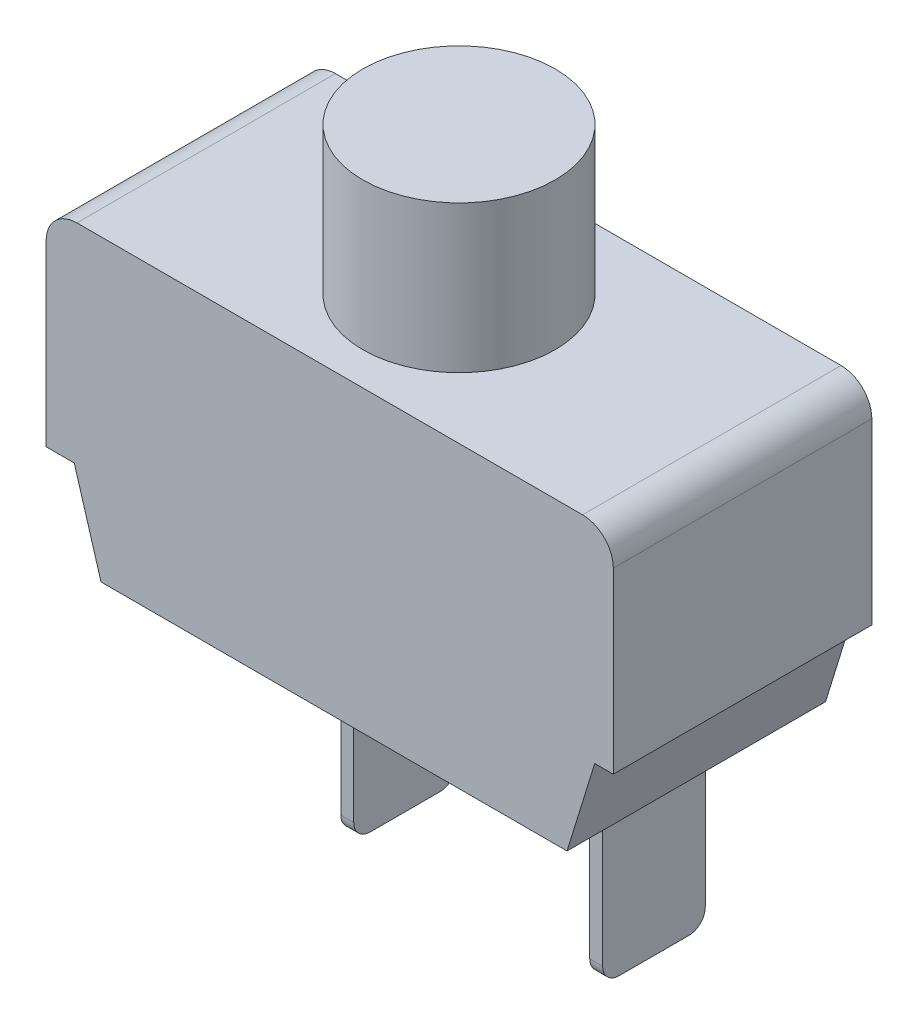
ISO-10303-21;
HEADER;
FILE_DESCRIPTION(('STEP AP214'),'2;1');
FILE_NAME('part.step','',(''),(''),'','','');
FILE_SCHEMA(('AUTOMOTIVE_DESIGN { 1 0 10303 214 1 1 1 1 }'));
ENDSEC;
DATA;
#1=APPLICATION_CONTEXT('core data for automotive mechanical design processes');
#2=APPLICATION_PROTOCOL_DEFINITION('international standard','automotive_design',2000,#1);
#3=PRODUCT_CONTEXT('',#1,'mechanical');
#4=PRODUCT('Part','Part','',(#3));
#5=PRODUCT_RELATED_PRODUCT_CATEGORY('part','',(#4));
#6=PRODUCT_DEFINITION_FORMATION('','',#4);
#7=PRODUCT_DEFINITION_CONTEXT('part definition',#1,'design');
#8=PRODUCT_DEFINITION('design','',#6,#7);
#9=PRODUCT_DEFINITION_SHAPE('','',#8);
#10=(LENGTH_UNIT() NAMED_UNIT(*) SI_UNIT(.MILLI.,.METRE.));
#11=(NAMED_UNIT(*) PLANE_ANGLE_UNIT() SI_UNIT($,.RADIAN.));
#12=(NAMED_UNIT(*) SI_UNIT($,.STERADIAN.) SOLID_ANGLE_UNIT());
#13=UNCERTAINTY_MEASURE_WITH_UNIT(LENGTH_MEASURE(1.E-05),#10,'distance_accuracy_value','');
#14=(GEOMETRIC_REPRESENTATION_CONTEXT(3) GLOBAL_UNCERTAINTY_ASSIGNED_CONTEXT((#13)) GLOBAL_UNIT_ASSIGNED_CONTEXT((#10,
#11,#12)) REPRESENTATION_CONTEXT('',''));
#15=CARTESIAN_POINT('',(0.,0.,0.));
#16=DIRECTION('',(0.,0.,1.));
#17=DIRECTION('',(1.,0.,0.));
#18=AXIS2_PLACEMENT_3D('',#15,#16,#17);
#19=CARTESIAN_POINT('',(0.,0.,8.));
#20=DIRECTION('',(0.,1.,0.));
#21=DIRECTION('',(0.,0.,1.));
#22=AXIS2_PLACEMENT_3D('',#19,#20,#21);
#23=PLANE('',#22);
#24=DIRECTION('',(1.,0.,0.));
#25=VECTOR('',#24,1.);
#26=CARTESIAN_POINT('',(0.,0.,-8.));
#27=LINE('',#26,#25);
#28=CARTESIAN_POINT('',(-15.645,0.,-8.));
#29=VERTEX_POINT('',#28);
#30=CARTESIAN_POINT('',(15.645,0.,-8.));
#31=VERTEX_POINT('',#30);
#32=EDGE_CURVE('E302',#29,#31,#27,.T.);
#33=ORIENTED_EDGE('',*,*,#32,.F.);
#34=DIRECTION('',(0.,0.,-1.));
#35=VECTOR('',#34,1.);
#36=CARTESIAN_POINT('',(-15.645,0.,8.));
#37=LINE('',#36,#35);
#38=CARTESIAN_POINT('',(-15.645,0.,8.));
#39=VERTEX_POINT('',#38);
#40=EDGE_CURVE('E329',#29,#39,#37,.F.);
#41=ORIENTED_EDGE('',*,*,#40,.T.);
#42=DIRECTION('',(1.,0.,0.));
#43=VECTOR('',#42,1.);
#44=CARTESIAN_POINT('',(0.,0.,8.));
#45=LINE('',#44,#43);
#46=CARTESIAN_POINT('',(15.645,0.,8.));
#47=VERTEX_POINT('',#46);
#48=EDGE_CURVE('E279',#39,#47,#45,.T.);
#49=ORIENTED_EDGE('',*,*,#48,.T.);
#50=DIRECTION('',(0.,0.,-1.));
#51=VECTOR('',#50,1.);
#52=CARTESIAN_POINT('',(15.645,0.,8.));
#53=LINE('',#52,#51);
#54=EDGE_CURVE('E326',#47,#31,#53,.T.);
#55=ORIENTED_EDGE('',*,*,#54,.T.);
#56=EDGE_LOOP('',(#33,#41,#49,#55));
#57=FACE_BOUND('',#56,.T.);
#58=CARTESIAN_POINT('',(0.,0.,0.));
#59=DIRECTION('',(0.,1.,0.));
#60=DIRECTION('',(0.,0.,1.));
#61=AXIS2_PLACEMENT_3D('',#58,#59,#60);
#62=CIRCLE('',#61,5.953125);
#63=CARTESIAN_POINT('',(0.,0.,5.953125));
#64=VERTEX_POINT('',#63);
#65=EDGE_CURVE('E254',#64,#64,#62,.T.);
#66=ORIENTED_EDGE('',*,*,#65,.F.);
#67=EDGE_LOOP('',(#66));
#68=FACE_BOUND('',#67,.T.);
#69=ADVANCED_FACE('F35',(#57,#68),#23,.T.);
#70=CARTESIAN_POINT('',(0.,-12.9538538438508,8.));
#71=DIRECTION('',(0.,-1.,0.));
#72=DIRECTION('',(0.,0.,-1.));
#73=AXIS2_PLACEMENT_3D('',#70,#71,#72);
#74=PLANE('',#73);
#75=DIRECTION('',(-1.,0.,0.));
#76=VECTOR('',#75,1.);
#77=CARTESIAN_POINT('',(0.,-12.9538538438508,-8.));
#78=LINE('',#77,#76);
#79=CARTESIAN_POINT('',(-15.8104690070951,-12.9538538438508,-8.));
#80=VERTEX_POINT('',#79);
#81=CARTESIAN_POINT('',(-17.55,-12.9538538438508,-8.));
#82=VERTEX_POINT('',#81);
#83=EDGE_CURVE('E258',#80,#82,#78,.T.);
#84=ORIENTED_EDGE('',*,*,#83,.F.);
#85=DIRECTION('',(0.,0.,-1.));
#86=VECTOR('',#85,1.);
#87=CARTESIAN_POINT('',(-15.8104690070951,-12.9538538438508,8.));
#88=LINE('',#87,#86);
#89=CARTESIAN_POINT('',(-15.8104690070951,-12.9538538438508,8.));
#90=VERTEX_POINT('',#89);
#91=EDGE_CURVE('E317',#90,#80,#88,.T.);
#92=ORIENTED_EDGE('',*,*,#91,.F.);
#93=DIRECTION('',(-1.,0.,0.));
#94=VECTOR('',#93,1.);
#95=CARTESIAN_POINT('',(0.,-12.9538538438508,8.));
#96=LINE('',#95,#94);
#97=CARTESIAN_POINT('',(-17.55,-12.9538538438508,8.));
#98=VERTEX_POINT('',#97);
#99=EDGE_CURVE('E261',#90,#98,#96,.T.);
#100=ORIENTED_EDGE('',*,*,#99,.T.);
#101=DIRECTION('',(0.,0.,-1.));
#102=VECTOR('',#101,1.);
#103=CARTESIAN_POINT('',(-17.55,-12.9538538438508,8.));
#104=LINE('',#103,#102);
#105=EDGE_CURVE('E285',#98,#82,#104,.T.);
#106=ORIENTED_EDGE('',*,*,#105,.T.);
#107=EDGE_LOOP('',(#84,#92,#100,#106));
#108=FACE_BOUND('',#107,.T.);
#109=ADVANCED_FACE('F438',(#108),#74,.T.);
#110=CARTESIAN_POINT('',(-18.0675079762978,-5.39456248557498,8.));
#111=DIRECTION('',(-0.958200455940923,-0.286097686524388,0.));
#112=DIRECTION('',(0.286097686524388,-0.958200455940923,0.));
#113=AXIS2_PLACEMENT_3D('',#110,#111,#112);
#114=PLANE('',#113);
#115=DIRECTION('',(-0.286097686524388,0.958200455940923,0.));
#116=VECTOR('',#115,1.);
#117=CARTESIAN_POINT('',(-18.0675079762978,-5.39456248557498,-8.));
#118=LINE('',#117,#116);
#119=CARTESIAN_POINT('',(-14.1545111388197,-18.5,-8.));
#120=VERTEX_POINT('',#119);
#121=EDGE_CURVE('E288',#120,#80,#118,.T.);
#122=ORIENTED_EDGE('',*,*,#121,.F.);
#123=DIRECTION('',(0.,0.,-1.));
#124=VECTOR('',#123,1.);
#125=CARTESIAN_POINT('',(-14.1545111388197,-18.5,8.));
#126=LINE('',#125,#124);
#127=CARTESIAN_POINT('',(-14.1545111388197,-18.5,8.));
#128=VERTEX_POINT('',#127);
#129=EDGE_CURVE('E315',#128,#120,#126,.T.);
#130=ORIENTED_EDGE('',*,*,#129,.F.);
#131=DIRECTION('',(-0.286097686524388,0.958200455940923,0.));
#132=VECTOR('',#131,1.);
#133=CARTESIAN_POINT('',(-18.0675079762978,-5.39456248557498,8.));
#134=LINE('',#133,#132);
#135=EDGE_CURVE('E264',#128,#90,#134,.T.);
#136=ORIENTED_EDGE('',*,*,#135,.T.);
#137=ORIENTED_EDGE('',*,*,#91,.T.);
#138=EDGE_LOOP('',(#122,#130,#136,#137));
#139=FACE_BOUND('',#138,.T.);
#140=ADVANCED_FACE('F394',(#139),#114,.T.);
#141=CARTESIAN_POINT('',(0.,-18.5,8.));
#142=DIRECTION('',(0.,-1.,0.));
#143=DIRECTION('',(1.,0.,0.));
#144=AXIS2_PLACEMENT_3D('',#141,#142,#143);
#145=PLANE('',#144);
#146=DIRECTION('',(1.,0.,0.));
#147=VECTOR('',#146,1.);
#148=CARTESIAN_POINT('',(11.2659599902533,-18.5,3.175));
#149=LINE('',#148,#147);
#150=CARTESIAN_POINT('',(11.2659599902533,-18.5,3.175));
#151=VERTEX_POINT('',#150);
#152=CARTESIAN_POINT('',(12.0659599902533,-18.5,3.175));
#153=VERTEX_POINT('',#152);
#154=EDGE_CURVE('E210',#151,#153,#149,.T.);
#155=ORIENTED_EDGE('',*,*,#154,.T.);
#156=DIRECTION('',(0.,0.,-1.));
#157=VECTOR('',#156,1.);
#158=CARTESIAN_POINT('',(12.0659599902533,-18.5,3.175));
#159=LINE('',#158,#157);
#160=CARTESIAN_POINT('',(12.0659599902533,-18.5,-3.175));
#161=VERTEX_POINT('',#160);
#162=EDGE_CURVE('E189',#153,#161,#159,.T.);
#163=ORIENTED_EDGE('',*,*,#162,.T.);
#164=DIRECTION('',(1.,0.,0.));
#165=VECTOR('',#164,1.);
#166=CARTESIAN_POINT('',(11.2659599902533,-18.5,-3.175));
#167=LINE('',#166,#165);
#168=CARTESIAN_POINT('',(11.2659599902533,-18.5,-3.175));
#169=VERTEX_POINT('',#168);
#170=EDGE_CURVE('E196',#169,#161,#167,.T.);
#171=ORIENTED_EDGE('',*,*,#170,.F.);
#172=DIRECTION('',(0.,0.,-1.));
#173=VECTOR('',#172,1.);
#174=CARTESIAN_POINT('',(11.2659599902533,-18.5,3.175));
#175=LINE('',#174,#173);
#176=EDGE_CURVE('E211',#151,#169,#175,.T.);
#177=ORIENTED_EDGE('',*,*,#176,.F.);
#178=EDGE_LOOP('',(#155,#163,#171,#177));
#179=FACE_BOUND('',#178,.T.);
#180=DIRECTION('',(1.,0.,0.));
#181=VECTOR('',#180,1.);
#182=CARTESIAN_POINT('',(-4.1400943747059,-18.5,3.175));
#183=LINE('',#182,#181);
#184=CARTESIAN_POINT('',(-4.1400943747059,-18.5,3.175));
#185=VERTEX_POINT('',#184);
#186=CARTESIAN_POINT('',(-3.3400943747059,-18.5,3.175));
#187=VERTEX_POINT('',#186);
#188=EDGE_CURVE('E232',#185,#187,#183,.T.);
#189=ORIENTED_EDGE('',*,*,#188,.T.);
#190=DIRECTION('',(0.,0.,-1.));
#191=VECTOR('',#190,1.);
#192=CARTESIAN_POINT('',(-3.3400943747059,-18.5,3.175));
#193=LINE('',#192,#191);
#194=CARTESIAN_POINT('',(-3.3400943747059,-18.5,-3.175));
#195=VERTEX_POINT('',#194);
#196=EDGE_CURVE('E245',#187,#195,#193,.T.);
#197=ORIENTED_EDGE('',*,*,#196,.T.);
#198=DIRECTION('',(1.,0.,0.));
#199=VECTOR('',#198,1.);
#200=CARTESIAN_POINT('',(-4.1400943747059,-18.5,-3.175));
#201=LINE('',#200,#199);
#202=CARTESIAN_POINT('',(-4.1400943747059,-18.5,-3.175));
#203=VERTEX_POINT('',#202);
#204=EDGE_CURVE('E229',#203,#195,#201,.T.);
#205=ORIENTED_EDGE('',*,*,#204,.F.);
#206=DIRECTION('',(0.,0.,-1.));
#207=VECTOR('',#206,1.);
#208=CARTESIAN_POINT('',(-4.1400943747059,-18.5,3.175));
#209=LINE('',#208,#207);
#210=EDGE_CURVE('E235',#185,#203,#209,.T.);
#211=ORIENTED_EDGE('',*,*,#210,.F.);
#212=EDGE_LOOP('',(#189,#197,#205,#211));
#213=FACE_BOUND('',#212,.T.);
#214=DIRECTION('',(-1.,0.,0.));
#215=VECTOR('',#214,1.);
#216=CARTESIAN_POINT('',(0.,-18.5,-8.));
#217=LINE('',#216,#215);
#218=CARTESIAN_POINT('',(14.6867200634041,-18.5,-8.));
#219=VERTEX_POINT('',#218);
#220=EDGE_CURVE('E291',#219,#120,#217,.T.);
#221=ORIENTED_EDGE('',*,*,#220,.F.);
#222=DIRECTION('',(0.,0.,-1.));
#223=VECTOR('',#222,1.);
#224=CARTESIAN_POINT('',(14.6867200634041,-18.5,8.));
#225=LINE('',#224,#223);
#226=CARTESIAN_POINT('',(14.6867200634041,-18.5,8.));
#227=VERTEX_POINT('',#226);
#228=EDGE_CURVE('E313',#227,#219,#225,.T.);
#229=ORIENTED_EDGE('',*,*,#228,.F.);
#230=DIRECTION('',(-1.,0.,0.));
#231=VECTOR('',#230,1.);
#232=CARTESIAN_POINT('',(0.,-18.5,8.));
#233=LINE('',#232,#231);
#234=EDGE_CURVE('E268',#227,#128,#233,.T.);
#235=ORIENTED_EDGE('',*,*,#234,.T.);
#236=ORIENTED_EDGE('',*,*,#129,.T.);
#237=EDGE_LOOP('',(#221,#229,#235,#236));
#238=FACE_BOUND('',#237,.T.);
#239=ADVANCED_FACE('F207',(#179,#213,#238),#145,.T.);
#240=CARTESIAN_POINT('',(18.6207418627521,-5.74171044639979,8.));
#241=DIRECTION('',(0.955602111196758,-0.294660151829696,0.));
#242=DIRECTION('',(0.294660151829696,0.955602111196758,0.));
#243=AXIS2_PLACEMENT_3D('',#240,#241,#242);
#244=PLANE('',#243);
#245=DIRECTION('',(-0.294660151829696,-0.955602111196758,0.));
#246=VECTOR('',#245,1.);
#247=CARTESIAN_POINT('',(18.6207418627521,-5.74171044639979,-8.));
#248=LINE('',#247,#246);
#249=CARTESIAN_POINT('',(16.3968756284582,-12.9538538438508,-8.));
#250=VERTEX_POINT('',#249);
#251=EDGE_CURVE('E294',#250,#219,#248,.T.);
#252=ORIENTED_EDGE('',*,*,#251,.F.);
#253=DIRECTION('',(0.,0.,-1.));
#254=VECTOR('',#253,1.);
#255=CARTESIAN_POINT('',(16.3968756284582,-12.9538538438508,8.));
#256=LINE('',#255,#254);
#257=CARTESIAN_POINT('',(16.3968756284582,-12.9538538438508,8.));
#258=VERTEX_POINT('',#257);
#259=EDGE_CURVE('E311',#258,#250,#256,.T.);
#260=ORIENTED_EDGE('',*,*,#259,.F.);
#261=DIRECTION('',(-0.294660151829696,-0.955602111196758,0.));
#262=VECTOR('',#261,1.);
#263=CARTESIAN_POINT('',(18.6207418627521,-5.74171044639979,8.));
#264=LINE('',#263,#262);
#265=EDGE_CURVE('E271',#258,#227,#264,.T.);
#266=ORIENTED_EDGE('',*,*,#265,.T.);
#267=ORIENTED_EDGE('',*,*,#228,.T.);
#268=EDGE_LOOP('',(#252,#260,#266,#267));
#269=FACE_BOUND('',#268,.T.);
#270=ADVANCED_FACE('F393',(#269),#244,.T.);
#271=CARTESIAN_POINT('',(0.,-12.9538538438508,8.));
#272=DIRECTION('',(0.,-1.,0.));
#273=DIRECTION('',(0.,0.,-1.));
#274=AXIS2_PLACEMENT_3D('',#271,#272,#273);
#275=PLANE('',#274);
#276=DIRECTION('',(-1.,0.,0.));
#277=VECTOR('',#276,1.);
#278=CARTESIAN_POINT('',(0.,-12.9538538438508,-8.));
#279=LINE('',#278,#277);
#280=CARTESIAN_POINT('',(17.55,-12.9538538438508,-8.));
#281=VERTEX_POINT('',#280);
#282=EDGE_CURVE('E297',#281,#250,#279,.T.);
#283=ORIENTED_EDGE('',*,*,#282,.F.);
#284=DIRECTION('',(0.,0.,-1.));
#285=VECTOR('',#284,1.);
#286=CARTESIAN_POINT('',(17.55,-12.9538538438508,8.));
#287=LINE('',#286,#285);
#288=CARTESIAN_POINT('',(17.55,-12.9538538438508,8.));
#289=VERTEX_POINT('',#288);
#290=EDGE_CURVE('E308',#289,#281,#287,.T.);
#291=ORIENTED_EDGE('',*,*,#290,.F.);
#292=DIRECTION('',(-1.,0.,0.));
#293=VECTOR('',#292,1.);
#294=CARTESIAN_POINT('',(0.,-12.9538538438508,8.));
#295=LINE('',#294,#293);
#296=EDGE_CURVE('E274',#289,#258,#295,.T.);
#297=ORIENTED_EDGE('',*,*,#296,.T.);
#298=ORIENTED_EDGE('',*,*,#259,.T.);
#299=EDGE_LOOP('',(#283,#291,#297,#298));
#300=FACE_BOUND('',#299,.T.);
#301=ADVANCED_FACE('F413',(#300),#275,.T.);
#302=CARTESIAN_POINT('',(17.55,0.,8.));
#303=DIRECTION('',(1.,0.,0.));
#304=DIRECTION('',(0.,0.,-1.));
#305=AXIS2_PLACEMENT_3D('',#302,#303,#304);
#306=PLANE('',#305);
#307=DIRECTION('',(0.,-1.,0.));
#308=VECTOR('',#307,1.);
#309=CARTESIAN_POINT('',(17.55,0.,-8.));
#310=LINE('',#309,#308);
#311=CARTESIAN_POINT('',(17.55,-1.905,-8.));
#312=VERTEX_POINT('',#311);
#313=EDGE_CURVE('E300',#312,#281,#310,.T.);
#314=ORIENTED_EDGE('',*,*,#313,.F.);
#315=DIRECTION('',(0.,0.,-1.));
#316=VECTOR('',#315,1.);
#317=CARTESIAN_POINT('',(17.55,-1.905,8.));
#318=LINE('',#317,#316);
#319=CARTESIAN_POINT('',(17.55,-1.905,8.));
#320=VERTEX_POINT('',#319);
#321=EDGE_CURVE('E335',#312,#320,#318,.F.);
#322=ORIENTED_EDGE('',*,*,#321,.T.);
#323=DIRECTION('',(0.,-1.,0.));
#324=VECTOR('',#323,1.);
#325=CARTESIAN_POINT('',(17.55,0.,8.));
#326=LINE('',#325,#324);
#327=EDGE_CURVE('E277',#320,#289,#326,.T.);
#328=ORIENTED_EDGE('',*,*,#327,.T.);
#329=ORIENTED_EDGE('',*,*,#290,.T.);
#330=EDGE_LOOP('',(#314,#322,#328,#329));
#331=FACE_BOUND('',#330,.T.);
#332=ADVANCED_FACE('F416',(#331),#306,.T.);
#333=CARTESIAN_POINT('',(-17.55,0.,8.));
#334=DIRECTION('',(-1.,0.,0.));
#335=DIRECTION('',(0.,0.,1.));
#336=AXIS2_PLACEMENT_3D('',#333,#334,#335);
#337=PLANE('',#336);
#338=DIRECTION('',(0.,1.,0.));
#339=VECTOR('',#338,1.);
#340=CARTESIAN_POINT('',(-17.55,0.,8.));
#341=LINE('',#340,#339);
#342=CARTESIAN_POINT('',(-17.55,-1.905,8.));
#343=VERTEX_POINT('',#342);
#344=EDGE_CURVE('E282',#98,#343,#341,.T.);
#345=ORIENTED_EDGE('',*,*,#344,.T.);
#346=DIRECTION('',(0.,0.,-1.));
#347=VECTOR('',#346,1.);
#348=CARTESIAN_POINT('',(-17.55,-1.905,8.));
#349=LINE('',#348,#347);
#350=CARTESIAN_POINT('',(-17.55,-1.905,-8.));
#351=VERTEX_POINT('',#350);
#352=EDGE_CURVE('E319',#343,#351,#349,.T.);
#353=ORIENTED_EDGE('',*,*,#352,.T.);
#354=DIRECTION('',(0.,1.,0.));
#355=VECTOR('',#354,1.);
#356=CARTESIAN_POINT('',(-17.55,0.,-8.));
#357=LINE('',#356,#355);
#358=EDGE_CURVE('E265',#82,#351,#357,.T.);
#359=ORIENTED_EDGE('',*,*,#358,.F.);
#360=ORIENTED_EDGE('',*,*,#105,.F.);
#361=EDGE_LOOP('',(#345,#353,#359,#360));
#362=FACE_BOUND('',#361,.T.);
#363=ADVANCED_FACE('F432',(#362),#337,.T.);
#364=CARTESIAN_POINT('',(0.,0.,8.));
#365=DIRECTION('',(0.,0.,1.));
#366=DIRECTION('',(1.,0.,0.));
#367=AXIS2_PLACEMENT_3D('',#364,#365,#366);
#368=PLANE('',#367);
#369=ORIENTED_EDGE('',*,*,#48,.F.);
#370=CARTESIAN_POINT('',(-15.645,-1.905,8.));
#371=DIRECTION('',(0.,0.,1.));
#372=DIRECTION('',(1.,0.,0.));
#373=AXIS2_PLACEMENT_3D('',#370,#371,#372);
#374=CIRCLE('',#373,1.905);
#375=EDGE_CURVE('E333',#39,#343,#374,.T.);
#376=ORIENTED_EDGE('',*,*,#375,.T.);
#377=ORIENTED_EDGE('',*,*,#344,.F.);
#378=ORIENTED_EDGE('',*,*,#99,.F.);
#379=ORIENTED_EDGE('',*,*,#135,.F.);
#380=ORIENTED_EDGE('',*,*,#234,.F.);
#381=ORIENTED_EDGE('',*,*,#265,.F.);
#382=ORIENTED_EDGE('',*,*,#296,.F.);
#383=ORIENTED_EDGE('',*,*,#327,.F.);
#384=CARTESIAN_POINT('',(15.645,-1.905,8.));
#385=DIRECTION('',(0.,0.,1.));
#386=DIRECTION('',(1.,0.,0.));
#387=AXIS2_PLACEMENT_3D('',#384,#385,#386);
#388=CIRCLE('',#387,1.905);
#389=EDGE_CURVE('E331',#320,#47,#388,.T.);
#390=ORIENTED_EDGE('',*,*,#389,.T.);
#391=EDGE_LOOP('',(#369,#376,#377,#378,#379,#380,#381,#382,#383,#390));
#392=FACE_BOUND('',#391,.T.);
#393=ADVANCED_FACE('F408',(#392),#368,.T.);
#394=CARTESIAN_POINT('',(0.,0.,-8.));
#395=DIRECTION('',(0.,0.,1.));
#396=DIRECTION('',(1.,0.,0.));
#397=AXIS2_PLACEMENT_3D('',#394,#395,#396);
#398=PLANE('',#397);
#399=ORIENTED_EDGE('',*,*,#358,.T.);
#400=CARTESIAN_POINT('',(-15.645,-1.905,-8.));
#401=DIRECTION('',(0.,0.,1.));
#402=DIRECTION('',(1.,0.,0.));
#403=AXIS2_PLACEMENT_3D('',#400,#401,#402);
#404=CIRCLE('',#403,1.905);
#405=EDGE_CURVE('E324',#351,#29,#404,.F.);
#406=ORIENTED_EDGE('',*,*,#405,.T.);
#407=ORIENTED_EDGE('',*,*,#32,.T.);
#408=CARTESIAN_POINT('',(15.645,-1.905,-8.));
#409=DIRECTION('',(0.,0.,1.));
#410=DIRECTION('',(1.,0.,0.));
#411=AXIS2_PLACEMENT_3D('',#408,#409,#410);
#412=CIRCLE('',#411,1.905);
#413=EDGE_CURVE('E322',#31,#312,#412,.F.);
#414=ORIENTED_EDGE('',*,*,#413,.T.);
#415=ORIENTED_EDGE('',*,*,#313,.T.);
#416=ORIENTED_EDGE('',*,*,#282,.T.);
#417=ORIENTED_EDGE('',*,*,#251,.T.);
#418=ORIENTED_EDGE('',*,*,#220,.T.);
#419=ORIENTED_EDGE('',*,*,#121,.T.);
#420=ORIENTED_EDGE('',*,*,#83,.T.);
#421=EDGE_LOOP('',(#399,#406,#407,#414,#415,#416,#417,#418,#419,#420));
#422=FACE_BOUND('',#421,.T.);
#423=ADVANCED_FACE('F401',(#422),#398,.F.);
#424=CARTESIAN_POINT('',(-15.645,-1.905,8.));
#425=DIRECTION('',(0.,0.,-1.));
#426=DIRECTION('',(-1.,0.,0.));
#427=AXIS2_PLACEMENT_3D('',#424,#425,#426);
#428=CYLINDRICAL_SURFACE('',#427,1.905);
#429=ORIENTED_EDGE('',*,*,#375,.F.);
#430=ORIENTED_EDGE('',*,*,#40,.F.);
#431=ORIENTED_EDGE('',*,*,#405,.F.);
#432=ORIENTED_EDGE('',*,*,#352,.F.);
#433=EDGE_LOOP('',(#429,#430,#431,#432));
#434=FACE_BOUND('',#433,.T.);
#435=ADVANCED_FACE('F430',(#434),#428,.T.);
#436=CARTESIAN_POINT('',(15.645,-1.905,8.));
#437=DIRECTION('',(0.,0.,-1.));
#438=DIRECTION('',(-1.,0.,0.));
#439=AXIS2_PLACEMENT_3D('',#436,#437,#438);
#440=CYLINDRICAL_SURFACE('',#439,1.905);
#441=ORIENTED_EDGE('',*,*,#389,.F.);
#442=ORIENTED_EDGE('',*,*,#321,.F.);
#443=ORIENTED_EDGE('',*,*,#413,.F.);
#444=ORIENTED_EDGE('',*,*,#54,.F.);
#445=EDGE_LOOP('',(#441,#442,#443,#444));
#446=FACE_BOUND('',#445,.T.);
#447=ADVANCED_FACE('F421',(#446),#440,.T.);
#448=CARTESIAN_POINT('',(0.,9.1,0.));
#449=DIRECTION('',(0.,-1.,0.));
#450=DIRECTION('',(0.,0.,-1.));
#451=AXIS2_PLACEMENT_3D('',#448,#449,#450);
#452=CYLINDRICAL_SURFACE('',#451,5.953125);
#453=CARTESIAN_POINT('',(0.,9.1,0.));
#454=DIRECTION('',(0.,1.,0.));
#455=DIRECTION('',(0.,0.,1.));
#456=AXIS2_PLACEMENT_3D('',#453,#454,#455);
#457=CIRCLE('',#456,5.953125);
#458=CARTESIAN_POINT('',(0.,9.1,5.953125));
#459=VERTEX_POINT('',#458);
#460=EDGE_CURVE('E255',#459,#459,#457,.T.);
#461=ORIENTED_EDGE('',*,*,#460,.F.);
#462=EDGE_LOOP('',(#461));
#463=FACE_BOUND('',#462,.T.);
#464=ORIENTED_EDGE('',*,*,#65,.T.);
#465=EDGE_LOOP('',(#464));
#466=FACE_BOUND('',#465,.T.);
#467=ADVANCED_FACE('F452',(#463,#466),#452,.T.);
#468=CARTESIAN_POINT('',(0.,9.1,0.));
#469=DIRECTION('',(0.,1.,0.));
#470=DIRECTION('',(0.,0.,1.));
#471=AXIS2_PLACEMENT_3D('',#468,#469,#470);
#472=PLANE('',#471);
#473=ORIENTED_EDGE('',*,*,#460,.T.);
#474=EDGE_LOOP('',(#473));
#475=FACE_BOUND('',#474,.T.);
#476=ADVANCED_FACE('F491',(#475),#472,.T.);
#477=CARTESIAN_POINT('',(-4.1400943747059,-18.5,3.175));
#478=DIRECTION('',(1.,0.,0.));
#479=DIRECTION('',(0.,0.,-1.));
#480=AXIS2_PLACEMENT_3D('',#477,#478,#479);
#481=PLANE('',#480);
#482=DIRECTION('',(0.,1.,0.));
#483=VECTOR('',#482,1.);
#484=CARTESIAN_POINT('',(-4.1400943747059,-18.5,-3.175));
#485=LINE('',#484,#483);
#486=CARTESIAN_POINT('',(-4.1400943747059,-28.4006872537431,-3.175));
#487=VERTEX_POINT('',#486);
#488=EDGE_CURVE('E220',#203,#487,#485,.F.);
#489=ORIENTED_EDGE('',*,*,#488,.T.);
#490=CARTESIAN_POINT('',(-4.1400943747059,-28.4006872537431,-2.159));
#491=DIRECTION('',(1.,0.,0.));
#492=DIRECTION('',(0.,0.,-1.));
#493=AXIS2_PLACEMENT_3D('',#490,#491,#492);
#494=CIRCLE('',#493,1.016);
#495=CARTESIAN_POINT('',(-4.1400943747059,-29.4166872537431,-2.159));
#496=VERTEX_POINT('',#495);
#497=EDGE_CURVE('E342',#487,#496,#494,.F.);
#498=ORIENTED_EDGE('',*,*,#497,.T.);
#499=DIRECTION('',(0.,0.,-1.));
#500=VECTOR('',#499,1.);
#501=CARTESIAN_POINT('',(-4.1400943747059,-29.4166872537431,3.175));
#502=LINE('',#501,#500);
#503=CARTESIAN_POINT('',(-4.1400943747059,-29.4166872537431,2.159));
#504=VERTEX_POINT('',#503);
#505=EDGE_CURVE('E251',#504,#496,#502,.T.);
#506=ORIENTED_EDGE('',*,*,#505,.F.);
#507=CARTESIAN_POINT('',(-4.1400943747059,-28.4006872537431,2.159));
#508=DIRECTION('',(1.,0.,0.));
#509=DIRECTION('',(0.,0.,-1.));
#510=AXIS2_PLACEMENT_3D('',#507,#508,#509);
#511=CIRCLE('',#510,1.016);
#512=CARTESIAN_POINT('',(-4.1400943747059,-28.4006872537431,3.175));
#513=VERTEX_POINT('',#512);
#514=EDGE_CURVE('E340',#504,#513,#511,.F.);
#515=ORIENTED_EDGE('',*,*,#514,.T.);
#516=DIRECTION('',(0.,1.,0.));
#517=VECTOR('',#516,1.);
#518=CARTESIAN_POINT('',(-4.1400943747059,-18.5,3.175));
#519=LINE('',#518,#517);
#520=EDGE_CURVE('E225',#185,#513,#519,.F.);
#521=ORIENTED_EDGE('',*,*,#520,.F.);
#522=ORIENTED_EDGE('',*,*,#210,.T.);
#523=EDGE_LOOP('',(#489,#498,#506,#515,#521,#522));
#524=FACE_BOUND('',#523,.T.);
#525=ADVANCED_FACE('F382',(#524),#481,.F.);
#526=CARTESIAN_POINT('',(-3.3400943747059,-29.4166872537431,3.175));
#527=DIRECTION('',(0.,-1.,0.));
#528=DIRECTION('',(0.,0.,-1.));
#529=AXIS2_PLACEMENT_3D('',#526,#527,#528);
#530=PLANE('',#529);
#531=ORIENTED_EDGE('',*,*,#505,.T.);
#532=DIRECTION('',(-1.,0.,0.));
#533=VECTOR('',#532,1.);
#534=CARTESIAN_POINT('',(-3.3400943747059,-29.4166872537431,-2.159));
#535=LINE('',#534,#533);
#536=CARTESIAN_POINT('',(-3.3400943747059,-29.4166872537431,-2.159));
#537=VERTEX_POINT('',#536);
#538=EDGE_CURVE('E347',#496,#537,#535,.F.);
#539=ORIENTED_EDGE('',*,*,#538,.T.);
#540=DIRECTION('',(0.,0.,-1.));
#541=VECTOR('',#540,1.);
#542=CARTESIAN_POINT('',(-3.3400943747059,-29.4166872537431,3.175));
#543=LINE('',#542,#541);
#544=CARTESIAN_POINT('',(-3.3400943747059,-29.4166872537431,2.159));
#545=VERTEX_POINT('',#544);
#546=EDGE_CURVE('E248',#545,#537,#543,.T.);
#547=ORIENTED_EDGE('',*,*,#546,.F.);
#548=DIRECTION('',(-1.,0.,0.));
#549=VECTOR('',#548,1.);
#550=CARTESIAN_POINT('',(-3.3400943747059,-29.4166872537431,2.159));
#551=LINE('',#550,#549);
#552=EDGE_CURVE('E344',#545,#504,#551,.T.);
#553=ORIENTED_EDGE('',*,*,#552,.T.);
#554=EDGE_LOOP('',(#531,#539,#547,#553));
#555=FACE_BOUND('',#554,.T.);
#556=ADVANCED_FACE('F379',(#555),#530,.T.);
#557=CARTESIAN_POINT('',(-3.3400943747059,-18.5,3.175));
#558=DIRECTION('',(1.,0.,0.));
#559=DIRECTION('',(0.,0.,-1.));
#560=AXIS2_PLACEMENT_3D('',#557,#558,#559);
#561=PLANE('',#560);
#562=ORIENTED_EDGE('',*,*,#546,.T.);
#563=CARTESIAN_POINT('',(-3.3400943747059,-28.4006872537431,-2.159));
#564=DIRECTION('',(1.,0.,0.));
#565=DIRECTION('',(0.,0.,-1.));
#566=AXIS2_PLACEMENT_3D('',#563,#564,#565);
#567=CIRCLE('',#566,1.016);
#568=CARTESIAN_POINT('',(-3.3400943747059,-28.4006872537431,-3.175));
#569=VERTEX_POINT('',#568);
#570=EDGE_CURVE('E351',#537,#569,#567,.T.);
#571=ORIENTED_EDGE('',*,*,#570,.T.);
#572=DIRECTION('',(0.,1.,0.));
#573=VECTOR('',#572,1.);
#574=CARTESIAN_POINT('',(-3.3400943747059,-18.5,-3.175));
#575=LINE('',#574,#573);
#576=EDGE_CURVE('E238',#195,#569,#575,.F.);
#577=ORIENTED_EDGE('',*,*,#576,.F.);
#578=ORIENTED_EDGE('',*,*,#196,.F.);
#579=DIRECTION('',(0.,1.,0.));
#580=VECTOR('',#579,1.);
#581=CARTESIAN_POINT('',(-3.3400943747059,-18.5,3.175));
#582=LINE('',#581,#580);
#583=CARTESIAN_POINT('',(-3.3400943747059,-28.4006872537431,3.175));
#584=VERTEX_POINT('',#583);
#585=EDGE_CURVE('E228',#187,#584,#582,.F.);
#586=ORIENTED_EDGE('',*,*,#585,.T.);
#587=CARTESIAN_POINT('',(-3.3400943747059,-28.4006872537431,2.159));
#588=DIRECTION('',(1.,0.,0.));
#589=DIRECTION('',(0.,0.,-1.));
#590=AXIS2_PLACEMENT_3D('',#587,#588,#589);
#591=CIRCLE('',#590,1.016);
#592=EDGE_CURVE('E349',#584,#545,#591,.T.);
#593=ORIENTED_EDGE('',*,*,#592,.T.);
#594=EDGE_LOOP('',(#562,#571,#577,#578,#586,#593));
#595=FACE_BOUND('',#594,.T.);
#596=ADVANCED_FACE('F373',(#595),#561,.T.);
#597=CARTESIAN_POINT('',(0.,0.,3.175));
#598=DIRECTION('',(0.,0.,1.));
#599=DIRECTION('',(1.,0.,0.));
#600=AXIS2_PLACEMENT_3D('',#597,#598,#599);
#601=PLANE('',#600);
#602=ORIENTED_EDGE('',*,*,#520,.T.);
#603=DIRECTION('',(-1.,0.,0.));
#604=VECTOR('',#603,1.);
#605=CARTESIAN_POINT('',(0.,-28.4006872537431,3.175));
#606=LINE('',#605,#604);
#607=EDGE_CURVE('E43',#513,#584,#606,.F.);
#608=ORIENTED_EDGE('',*,*,#607,.T.);
#609=ORIENTED_EDGE('',*,*,#585,.F.);
#610=ORIENTED_EDGE('',*,*,#188,.F.);
#611=EDGE_LOOP('',(#602,#608,#609,#610));
#612=FACE_BOUND('',#611,.T.);
#613=ADVANCED_FACE('F368',(#612),#601,.T.);
#614=CARTESIAN_POINT('',(0.,0.,-3.175));
#615=DIRECTION('',(0.,0.,1.));
#616=DIRECTION('',(1.,0.,0.));
#617=AXIS2_PLACEMENT_3D('',#614,#615,#616);
#618=PLANE('',#617);
#619=ORIENTED_EDGE('',*,*,#576,.T.);
#620=DIRECTION('',(-1.,0.,0.));
#621=VECTOR('',#620,1.);
#622=CARTESIAN_POINT('',(-4.1400943747059,-28.4006872537431,-3.175));
#623=LINE('',#622,#621);
#624=EDGE_CURVE('E337',#569,#487,#623,.T.);
#625=ORIENTED_EDGE('',*,*,#624,.T.);
#626=ORIENTED_EDGE('',*,*,#488,.F.);
#627=ORIENTED_EDGE('',*,*,#204,.T.);
#628=EDGE_LOOP('',(#619,#625,#626,#627));
#629=FACE_BOUND('',#628,.T.);
#630=ADVANCED_FACE('F388',(#629),#618,.F.);
#631=CARTESIAN_POINT('',(11.2659599902533,-18.5,3.175));
#632=DIRECTION('',(1.,0.,0.));
#633=DIRECTION('',(0.,0.,-1.));
#634=AXIS2_PLACEMENT_3D('',#631,#632,#633);
#635=PLANE('',#634);
#636=DIRECTION('',(0.,1.,0.));
#637=VECTOR('',#636,1.);
#638=CARTESIAN_POINT('',(11.2659599902533,-18.5,-3.175));
#639=LINE('',#638,#637);
#640=CARTESIAN_POINT('',(11.2659599902533,-28.4006872537431,-3.175));
#641=VERTEX_POINT('',#640);
#642=EDGE_CURVE('E195',#169,#641,#639,.F.);
#643=ORIENTED_EDGE('',*,*,#642,.T.);
#644=CARTESIAN_POINT('',(11.2659599902533,-28.4006872537431,-2.159));
#645=DIRECTION('',(1.,0.,0.));
#646=DIRECTION('',(0.,0.,-1.));
#647=AXIS2_PLACEMENT_3D('',#644,#645,#646);
#648=CIRCLE('',#647,1.016);
#649=CARTESIAN_POINT('',(11.2659599902533,-29.4166872537431,-2.159));
#650=VERTEX_POINT('',#649);
#651=EDGE_CURVE('E357',#641,#650,#648,.F.);
#652=ORIENTED_EDGE('',*,*,#651,.T.);
#653=DIRECTION('',(0.,0.,-1.));
#654=VECTOR('',#653,1.);
#655=CARTESIAN_POINT('',(11.2659599902533,-29.4166872537431,3.175));
#656=LINE('',#655,#654);
#657=CARTESIAN_POINT('',(11.2659599902533,-29.4166872537431,2.159));
#658=VERTEX_POINT('',#657);
#659=EDGE_CURVE('E215',#658,#650,#656,.T.);
#660=ORIENTED_EDGE('',*,*,#659,.F.);
#661=CARTESIAN_POINT('',(11.2659599902533,-28.4006872537431,2.159));
#662=DIRECTION('',(1.,0.,0.));
#663=DIRECTION('',(0.,0.,-1.));
#664=AXIS2_PLACEMENT_3D('',#661,#662,#663);
#665=CIRCLE('',#664,1.016);
#666=CARTESIAN_POINT('',(11.2659599902533,-28.4006872537431,3.175));
#667=VERTEX_POINT('',#666);
#668=EDGE_CURVE('E355',#658,#667,#665,.F.);
#669=ORIENTED_EDGE('',*,*,#668,.T.);
#670=DIRECTION('',(0.,1.,0.));
#671=VECTOR('',#670,1.);
#672=CARTESIAN_POINT('',(11.2659599902533,-18.5,3.175));
#673=LINE('',#672,#671);
#674=EDGE_CURVE('E204',#151,#667,#673,.F.);
#675=ORIENTED_EDGE('',*,*,#674,.F.);
#676=ORIENTED_EDGE('',*,*,#176,.T.);
#677=EDGE_LOOP('',(#643,#652,#660,#669,#675,#676));
#678=FACE_BOUND('',#677,.T.);
#679=ADVANCED_FACE('F470',(#678),#635,.F.);
#680=CARTESIAN_POINT('',(12.0659599902533,-29.4166872537431,3.175));
#681=DIRECTION('',(0.,-1.,0.));
#682=DIRECTION('',(0.,0.,-1.));
#683=AXIS2_PLACEMENT_3D('',#680,#681,#682);
#684=PLANE('',#683);
#685=ORIENTED_EDGE('',*,*,#659,.T.);
#686=DIRECTION('',(-1.,0.,0.));
#687=VECTOR('',#686,1.);
#688=CARTESIAN_POINT('',(12.0659599902533,-29.4166872537431,-2.159));
#689=LINE('',#688,#687);
#690=CARTESIAN_POINT('',(12.0659599902533,-29.4166872537431,-2.159));
#691=VERTEX_POINT('',#690);
#692=EDGE_CURVE('E56',#650,#691,#689,.F.);
#693=ORIENTED_EDGE('',*,*,#692,.T.);
#694=DIRECTION('',(0.,0.,-1.));
#695=VECTOR('',#694,1.);
#696=CARTESIAN_POINT('',(12.0659599902533,-29.4166872537431,3.175));
#697=LINE('',#696,#695);
#698=CARTESIAN_POINT('',(12.0659599902533,-29.4166872537431,2.159));
#699=VERTEX_POINT('',#698);
#700=EDGE_CURVE('E212',#699,#691,#697,.T.);
#701=ORIENTED_EDGE('',*,*,#700,.F.);
#702=DIRECTION('',(-1.,0.,0.));
#703=VECTOR('',#702,1.);
#704=CARTESIAN_POINT('',(12.0659599902533,-29.4166872537431,2.159));
#705=LINE('',#704,#703);
#706=EDGE_CURVE('E359',#699,#658,#705,.T.);
#707=ORIENTED_EDGE('',*,*,#706,.T.);
#708=EDGE_LOOP('',(#685,#693,#701,#707));
#709=FACE_BOUND('',#708,.T.);
#710=ADVANCED_FACE('F467',(#709),#684,.T.);
#711=CARTESIAN_POINT('',(12.0659599902533,-18.5,3.175));
#712=DIRECTION('',(1.,0.,0.));
#713=DIRECTION('',(0.,0.,-1.));
#714=AXIS2_PLACEMENT_3D('',#711,#712,#713);
#715=PLANE('',#714);
#716=ORIENTED_EDGE('',*,*,#700,.T.);
#717=CARTESIAN_POINT('',(12.0659599902533,-28.4006872537431,-2.159));
#718=DIRECTION('',(1.,0.,0.));
#719=DIRECTION('',(0.,0.,-1.));
#720=AXIS2_PLACEMENT_3D('',#717,#718,#719);
#721=CIRCLE('',#720,1.016);
#722=CARTESIAN_POINT('',(12.0659599902533,-28.4006872537431,-3.175));
#723=VERTEX_POINT('',#722);
#724=EDGE_CURVE('E191',#691,#723,#721,.T.);
#725=ORIENTED_EDGE('',*,*,#724,.T.);
#726=DIRECTION('',(0.,1.,0.));
#727=VECTOR('',#726,1.);
#728=CARTESIAN_POINT('',(12.0659599902533,-18.5,-3.175));
#729=LINE('',#728,#727);
#730=EDGE_CURVE('E185',#161,#723,#729,.F.);
#731=ORIENTED_EDGE('',*,*,#730,.F.);
#732=ORIENTED_EDGE('',*,*,#162,.F.);
#733=DIRECTION('',(0.,1.,0.));
#734=VECTOR('',#733,1.);
#735=CARTESIAN_POINT('',(12.0659599902533,-18.5,3.175));
#736=LINE('',#735,#734);
#737=CARTESIAN_POINT('',(12.0659599902533,-28.4006872537431,3.175));
#738=VERTEX_POINT('',#737);
#739=EDGE_CURVE('E222',#153,#738,#736,.F.);
#740=ORIENTED_EDGE('',*,*,#739,.T.);
#741=CARTESIAN_POINT('',(12.0659599902533,-28.4006872537431,2.159));
#742=DIRECTION('',(1.,0.,0.));
#743=DIRECTION('',(0.,0.,-1.));
#744=AXIS2_PLACEMENT_3D('',#741,#742,#743);
#745=CIRCLE('',#744,1.016);
#746=EDGE_CURVE('E363',#738,#699,#745,.T.);
#747=ORIENTED_EDGE('',*,*,#746,.T.);
#748=EDGE_LOOP('',(#716,#725,#731,#732,#740,#747));
#749=FACE_BOUND('',#748,.T.);
#750=ADVANCED_FACE('F187',(#749),#715,.T.);
#751=CARTESIAN_POINT('',(0.,0.,3.175));
#752=DIRECTION('',(0.,0.,1.));
#753=DIRECTION('',(1.,0.,0.));
#754=AXIS2_PLACEMENT_3D('',#751,#752,#753);
#755=PLANE('',#754);
#756=ORIENTED_EDGE('',*,*,#674,.T.);
#757=DIRECTION('',(-1.,0.,0.));
#758=VECTOR('',#757,1.);
#759=CARTESIAN_POINT('',(0.,-28.4006872537431,3.175));
#760=LINE('',#759,#758);
#761=EDGE_CURVE('E11',#667,#738,#760,.F.);
#762=ORIENTED_EDGE('',*,*,#761,.T.);
#763=ORIENTED_EDGE('',*,*,#739,.F.);
#764=ORIENTED_EDGE('',*,*,#154,.F.);
#765=EDGE_LOOP('',(#756,#762,#763,#764));
#766=FACE_BOUND('',#765,.T.);
#767=ADVANCED_FACE('F471',(#766),#755,.T.);
#768=CARTESIAN_POINT('',(0.,0.,-3.175));
#769=DIRECTION('',(0.,0.,1.));
#770=DIRECTION('',(1.,0.,0.));
#771=AXIS2_PLACEMENT_3D('',#768,#769,#770);
#772=PLANE('',#771);
#773=ORIENTED_EDGE('',*,*,#730,.T.);
#774=DIRECTION('',(-1.,0.,0.));
#775=VECTOR('',#774,1.);
#776=CARTESIAN_POINT('',(11.2659599902533,-28.4006872537431,-3.175));
#777=LINE('',#776,#775);
#778=EDGE_CURVE('E353',#723,#641,#777,.T.);
#779=ORIENTED_EDGE('',*,*,#778,.T.);
#780=ORIENTED_EDGE('',*,*,#642,.F.);
#781=ORIENTED_EDGE('',*,*,#170,.T.);
#782=EDGE_LOOP('',(#773,#779,#780,#781));
#783=FACE_BOUND('',#782,.T.);
#784=ADVANCED_FACE('F199',(#783),#772,.F.);
#785=CARTESIAN_POINT('',(0.,-28.4006872537431,-2.159));
#786=DIRECTION('',(1.,0.,0.));
#787=DIRECTION('',(0.,0.,-1.));
#788=AXIS2_PLACEMENT_3D('',#785,#786,#787);
#789=CYLINDRICAL_SURFACE('',#788,1.016);
#790=ORIENTED_EDGE('',*,*,#570,.F.);
#791=ORIENTED_EDGE('',*,*,#538,.F.);
#792=ORIENTED_EDGE('',*,*,#497,.F.);
#793=ORIENTED_EDGE('',*,*,#624,.F.);
#794=EDGE_LOOP('',(#790,#791,#792,#793));
#795=FACE_BOUND('',#794,.T.);
#796=ADVANCED_FACE('F386',(#795),#789,.T.);
#797=CARTESIAN_POINT('',(0.,-28.4006872537431,-2.159));
#798=DIRECTION('',(1.,0.,0.));
#799=DIRECTION('',(0.,0.,-1.));
#800=AXIS2_PLACEMENT_3D('',#797,#798,#799);
#801=CYLINDRICAL_SURFACE('',#800,1.016);
#802=ORIENTED_EDGE('',*,*,#724,.F.);
#803=ORIENTED_EDGE('',*,*,#692,.F.);
#804=ORIENTED_EDGE('',*,*,#651,.F.);
#805=ORIENTED_EDGE('',*,*,#778,.F.);
#806=EDGE_LOOP('',(#802,#803,#804,#805));
#807=FACE_BOUND('',#806,.T.);
#808=ADVANCED_FACE('F455',(#807),#801,.T.);
#809=CARTESIAN_POINT('',(-3.3400943747059,-28.4006872537431,2.159));
#810=DIRECTION('',(-1.,0.,0.));
#811=DIRECTION('',(0.,0.,1.));
#812=AXIS2_PLACEMENT_3D('',#809,#810,#811);
#813=CYLINDRICAL_SURFACE('',#812,1.016);
#814=ORIENTED_EDGE('',*,*,#592,.F.);
#815=ORIENTED_EDGE('',*,*,#607,.F.);
#816=ORIENTED_EDGE('',*,*,#514,.F.);
#817=ORIENTED_EDGE('',*,*,#552,.F.);
#818=EDGE_LOOP('',(#814,#815,#816,#817));
#819=FACE_BOUND('',#818,.T.);
#820=ADVANCED_FACE('F376',(#819),#813,.T.);
#821=CARTESIAN_POINT('',(12.0659599902533,-28.4006872537431,2.159));
#822=DIRECTION('',(-1.,0.,0.));
#823=DIRECTION('',(0.,0.,1.));
#824=AXIS2_PLACEMENT_3D('',#821,#822,#823);
#825=CYLINDRICAL_SURFACE('',#824,1.016);
#826=ORIENTED_EDGE('',*,*,#746,.F.);
#827=ORIENTED_EDGE('',*,*,#761,.F.);
#828=ORIENTED_EDGE('',*,*,#668,.F.);
#829=ORIENTED_EDGE('',*,*,#706,.F.);
#830=EDGE_LOOP('',(#826,#827,#828,#829));
#831=FACE_BOUND('',#830,.T.);
#832=ADVANCED_FACE('F37',(#831),#825,.T.);
#833=CLOSED_SHELL('',(#69,#109,#140,#239,#270,#301,#332,#363,#393,#423,#435,#447,#467,#476,#525,
#556,#596,#613,#630,#679,#710,#750,#767,#784,#796,#808,#820,#832));
#834=MANIFOLD_SOLID_BREP('B2',#833);
#835=ADVANCED_BREP_SHAPE_REPRESENTATION('',(#18,#834),#14);
#836=SHAPE_DEFINITION_REPRESENTATION(#9,#835);
ENDSEC;
END-ISO-10303-21;
